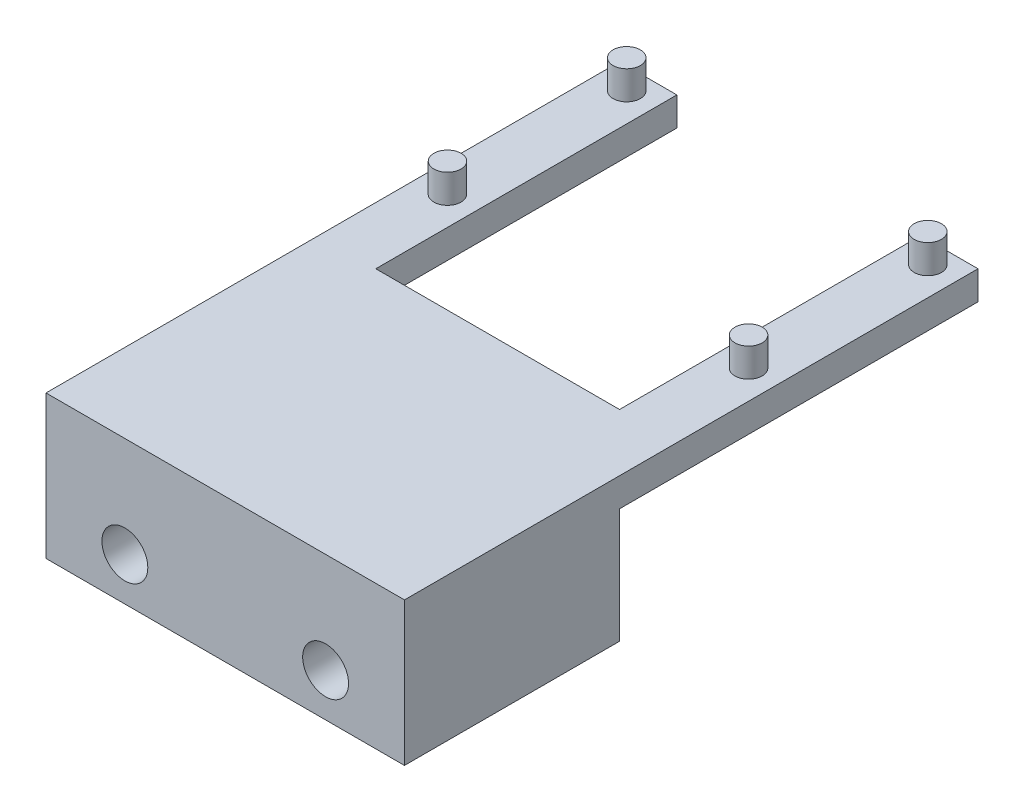
ISO-10303-21;
HEADER;
FILE_DESCRIPTION(('STEP AP214'),'2;1');
FILE_NAME('part.step','',(''),(''),'','','');
FILE_SCHEMA(('AUTOMOTIVE_DESIGN { 1 0 10303 214 1 1 1 1 }'));
ENDSEC;
DATA;
#1=APPLICATION_CONTEXT('core data for automotive mechanical design processes');
#2=APPLICATION_PROTOCOL_DEFINITION('international standard','automotive_design',2000,#1);
#3=PRODUCT_CONTEXT('',#1,'mechanical');
#4=PRODUCT('Part','Part','',(#3));
#5=PRODUCT_RELATED_PRODUCT_CATEGORY('part','',(#4));
#6=PRODUCT_DEFINITION_FORMATION('','',#4);
#7=PRODUCT_DEFINITION_CONTEXT('part definition',#1,'design');
#8=PRODUCT_DEFINITION('design','',#6,#7);
#9=PRODUCT_DEFINITION_SHAPE('','',#8);
#10=(LENGTH_UNIT() NAMED_UNIT(*) SI_UNIT(.MILLI.,.METRE.));
#11=(NAMED_UNIT(*) PLANE_ANGLE_UNIT() SI_UNIT($,.RADIAN.));
#12=(NAMED_UNIT(*) SI_UNIT($,.STERADIAN.) SOLID_ANGLE_UNIT());
#13=UNCERTAINTY_MEASURE_WITH_UNIT(LENGTH_MEASURE(1.E-05),#10,'distance_accuracy_value','');
#14=(GEOMETRIC_REPRESENTATION_CONTEXT(3) GLOBAL_UNCERTAINTY_ASSIGNED_CONTEXT((#13)) GLOBAL_UNIT_ASSIGNED_CONTEXT((#10,
#11,#12)) REPRESENTATION_CONTEXT('',''));
#15=CARTESIAN_POINT('',(0.,0.,0.));
#16=DIRECTION('',(0.,0.,1.));
#17=DIRECTION('',(1.,0.,0.));
#18=AXIS2_PLACEMENT_3D('',#15,#16,#17);
#19=CARTESIAN_POINT('',(12.5,2.,-12.5));
#20=DIRECTION('',(-1.,0.,0.));
#21=DIRECTION('',(0.,0.,1.));
#22=AXIS2_PLACEMENT_3D('',#19,#20,#21);
#23=PLANE('',#22);
#24=DIRECTION('',(0.,0.,-1.));
#25=VECTOR('',#24,1.);
#26=CARTESIAN_POINT('',(12.5,0.,-12.5));
#27=LINE('',#26,#25);
#28=CARTESIAN_POINT('',(12.5,0.,12.5));
#29=VERTEX_POINT('',#28);
#30=CARTESIAN_POINT('',(12.5,0.,-12.5));
#31=VERTEX_POINT('',#30);
#32=EDGE_CURVE('E130',#29,#31,#27,.T.);
#33=ORIENTED_EDGE('',*,*,#32,.T.);
#34=DIRECTION('',(0.,-1.,0.));
#35=VECTOR('',#34,1.);
#36=CARTESIAN_POINT('',(12.5,2.,-12.5));
#37=LINE('',#36,#35);
#38=CARTESIAN_POINT('',(12.5,2.,-12.5));
#39=VERTEX_POINT('',#38);
#40=EDGE_CURVE('E11',#39,#31,#37,.T.);
#41=ORIENTED_EDGE('',*,*,#40,.F.);
#42=DIRECTION('',(0.,0.,-1.));
#43=VECTOR('',#42,1.);
#44=CARTESIAN_POINT('',(12.5,2.,-12.5));
#45=LINE('',#44,#43);
#46=CARTESIAN_POINT('',(12.5,2.,27.5));
#47=VERTEX_POINT('',#46);
#48=EDGE_CURVE('E146',#47,#39,#45,.T.);
#49=ORIENTED_EDGE('',*,*,#48,.F.);
#50=DIRECTION('',(0.,1.,0.));
#51=VECTOR('',#50,1.);
#52=CARTESIAN_POINT('',(12.5,2.,27.5));
#53=LINE('',#52,#51);
#54=CARTESIAN_POINT('',(12.5,-8.,27.5));
#55=VERTEX_POINT('',#54);
#56=EDGE_CURVE('E175',#55,#47,#53,.T.);
#57=ORIENTED_EDGE('',*,*,#56,.F.);
#58=DIRECTION('',(0.,0.,-1.));
#59=VECTOR('',#58,1.);
#60=CARTESIAN_POINT('',(12.5,-8.,27.5));
#61=LINE('',#60,#59);
#62=CARTESIAN_POINT('',(12.5,-8.,12.5));
#63=VERTEX_POINT('',#62);
#64=EDGE_CURVE('E176',#55,#63,#61,.T.);
#65=ORIENTED_EDGE('',*,*,#64,.T.);
#66=DIRECTION('',(0.,1.,0.));
#67=VECTOR('',#66,1.);
#68=CARTESIAN_POINT('',(12.5,2.,12.5));
#69=LINE('',#68,#67);
#70=EDGE_CURVE('E191',#63,#29,#69,.T.);
#71=ORIENTED_EDGE('',*,*,#70,.T.);
#72=EDGE_LOOP('',(#33,#41,#49,#57,#65,#71));
#73=FACE_BOUND('',#72,.T.);
#74=ADVANCED_FACE('F33',(#73),#23,.F.);
#75=CARTESIAN_POINT('',(8.49999999999999,2.,-12.5));
#76=DIRECTION('',(0.,0.,1.));
#77=DIRECTION('',(1.,0.,0.));
#78=AXIS2_PLACEMENT_3D('',#75,#76,#77);
#79=PLANE('',#78);
#80=DIRECTION('',(-1.,0.,0.));
#81=VECTOR('',#80,1.);
#82=CARTESIAN_POINT('',(8.49999999999999,0.,-12.5));
#83=LINE('',#82,#81);
#84=CARTESIAN_POINT('',(8.49999999999999,0.,-12.5));
#85=VERTEX_POINT('',#84);
#86=EDGE_CURVE('E133',#31,#85,#83,.T.);
#87=ORIENTED_EDGE('',*,*,#86,.T.);
#88=DIRECTION('',(0.,-1.,0.));
#89=VECTOR('',#88,1.);
#90=CARTESIAN_POINT('',(8.49999999999999,2.,-12.5));
#91=LINE('',#90,#89);
#92=CARTESIAN_POINT('',(8.49999999999999,2.,-12.5));
#93=VERTEX_POINT('',#92);
#94=EDGE_CURVE('E41',#93,#85,#91,.T.);
#95=ORIENTED_EDGE('',*,*,#94,.F.);
#96=DIRECTION('',(-1.,0.,0.));
#97=VECTOR('',#96,1.);
#98=CARTESIAN_POINT('',(8.49999999999999,2.,-12.5));
#99=LINE('',#98,#97);
#100=EDGE_CURVE('E90',#39,#93,#99,.T.);
#101=ORIENTED_EDGE('',*,*,#100,.F.);
#102=ORIENTED_EDGE('',*,*,#40,.T.);
#103=EDGE_LOOP('',(#87,#95,#101,#102));
#104=FACE_BOUND('',#103,.T.);
#105=ADVANCED_FACE('F223',(#104),#79,.F.);
#106=CARTESIAN_POINT('',(8.49999999999999,2.,8.5));
#107=DIRECTION('',(1.,0.,0.));
#108=DIRECTION('',(0.,0.,-1.));
#109=AXIS2_PLACEMENT_3D('',#106,#107,#108);
#110=PLANE('',#109);
#111=DIRECTION('',(0.,0.,1.));
#112=VECTOR('',#111,1.);
#113=CARTESIAN_POINT('',(8.49999999999999,0.,8.5));
#114=LINE('',#113,#112);
#115=CARTESIAN_POINT('',(8.49999999999999,0.,8.5));
#116=VERTEX_POINT('',#115);
#117=EDGE_CURVE('E136',#85,#116,#114,.T.);
#118=ORIENTED_EDGE('',*,*,#117,.T.);
#119=DIRECTION('',(0.,-1.,0.));
#120=VECTOR('',#119,1.);
#121=CARTESIAN_POINT('',(8.49999999999999,2.,8.5));
#122=LINE('',#121,#120);
#123=CARTESIAN_POINT('',(8.49999999999999,2.,8.5));
#124=VERTEX_POINT('',#123);
#125=EDGE_CURVE('E119',#124,#116,#122,.T.);
#126=ORIENTED_EDGE('',*,*,#125,.F.);
#127=DIRECTION('',(0.,0.,1.));
#128=VECTOR('',#127,1.);
#129=CARTESIAN_POINT('',(8.49999999999999,2.,8.5));
#130=LINE('',#129,#128);
#131=EDGE_CURVE('E107',#93,#124,#130,.T.);
#132=ORIENTED_EDGE('',*,*,#131,.F.);
#133=ORIENTED_EDGE('',*,*,#94,.T.);
#134=EDGE_LOOP('',(#118,#126,#132,#133));
#135=FACE_BOUND('',#134,.T.);
#136=ADVANCED_FACE('F152',(#135),#110,.F.);
#137=CARTESIAN_POINT('',(-8.50000000000001,2.,8.5));
#138=DIRECTION('',(0.,0.,1.));
#139=DIRECTION('',(1.,0.,0.));
#140=AXIS2_PLACEMENT_3D('',#137,#138,#139);
#141=PLANE('',#140);
#142=DIRECTION('',(-1.,0.,0.));
#143=VECTOR('',#142,1.);
#144=CARTESIAN_POINT('',(-8.50000000000001,0.,8.5));
#145=LINE('',#144,#143);
#146=CARTESIAN_POINT('',(-8.50000000000001,0.,8.5));
#147=VERTEX_POINT('',#146);
#148=EDGE_CURVE('E116',#116,#147,#145,.T.);
#149=ORIENTED_EDGE('',*,*,#148,.T.);
#150=DIRECTION('',(0.,-1.,0.));
#151=VECTOR('',#150,1.);
#152=CARTESIAN_POINT('',(-8.50000000000001,2.,8.5));
#153=LINE('',#152,#151);
#154=CARTESIAN_POINT('',(-8.50000000000001,2.,8.5));
#155=VERTEX_POINT('',#154);
#156=EDGE_CURVE('E113',#155,#147,#153,.T.);
#157=ORIENTED_EDGE('',*,*,#156,.F.);
#158=DIRECTION('',(-1.,0.,0.));
#159=VECTOR('',#158,1.);
#160=CARTESIAN_POINT('',(-8.50000000000001,2.,8.5));
#161=LINE('',#160,#159);
#162=EDGE_CURVE('E100',#124,#155,#161,.T.);
#163=ORIENTED_EDGE('',*,*,#162,.F.);
#164=ORIENTED_EDGE('',*,*,#125,.T.);
#165=EDGE_LOOP('',(#149,#157,#163,#164));
#166=FACE_BOUND('',#165,.T.);
#167=ADVANCED_FACE('F114',(#166),#141,.F.);
#168=CARTESIAN_POINT('',(-8.50000000000001,2.,-12.5));
#169=DIRECTION('',(-1.,0.,0.));
#170=DIRECTION('',(0.,0.,1.));
#171=AXIS2_PLACEMENT_3D('',#168,#169,#170);
#172=PLANE('',#171);
#173=DIRECTION('',(0.,0.,-1.));
#174=VECTOR('',#173,1.);
#175=CARTESIAN_POINT('',(-8.50000000000001,0.,-12.5));
#176=LINE('',#175,#174);
#177=CARTESIAN_POINT('',(-8.50000000000001,0.,-12.5));
#178=VERTEX_POINT('',#177);
#179=EDGE_CURVE('E139',#147,#178,#176,.T.);
#180=ORIENTED_EDGE('',*,*,#179,.T.);
#181=DIRECTION('',(0.,-1.,0.));
#182=VECTOR('',#181,1.);
#183=CARTESIAN_POINT('',(-8.50000000000001,2.,-12.5));
#184=LINE('',#183,#182);
#185=CARTESIAN_POINT('',(-8.50000000000001,2.,-12.5));
#186=VERTEX_POINT('',#185);
#187=EDGE_CURVE('E120',#186,#178,#184,.T.);
#188=ORIENTED_EDGE('',*,*,#187,.F.);
#189=DIRECTION('',(0.,0.,-1.));
#190=VECTOR('',#189,1.);
#191=CARTESIAN_POINT('',(-8.50000000000001,2.,-12.5));
#192=LINE('',#191,#190);
#193=EDGE_CURVE('E104',#155,#186,#192,.T.);
#194=ORIENTED_EDGE('',*,*,#193,.F.);
#195=ORIENTED_EDGE('',*,*,#156,.T.);
#196=EDGE_LOOP('',(#180,#188,#194,#195));
#197=FACE_BOUND('',#196,.T.);
#198=ADVANCED_FACE('F122',(#197),#172,.F.);
#199=CARTESIAN_POINT('',(-12.5,2.,-12.5));
#200=DIRECTION('',(0.,0.,1.));
#201=DIRECTION('',(1.,0.,0.));
#202=AXIS2_PLACEMENT_3D('',#199,#200,#201);
#203=PLANE('',#202);
#204=DIRECTION('',(-1.,0.,0.));
#205=VECTOR('',#204,1.);
#206=CARTESIAN_POINT('',(-12.5,0.,-12.5));
#207=LINE('',#206,#205);
#208=CARTESIAN_POINT('',(-12.5,0.,-12.5));
#209=VERTEX_POINT('',#208);
#210=EDGE_CURVE('E75',#178,#209,#207,.T.);
#211=ORIENTED_EDGE('',*,*,#210,.T.);
#212=DIRECTION('',(0.,-1.,0.));
#213=VECTOR('',#212,1.);
#214=CARTESIAN_POINT('',(-12.5,2.,-12.5));
#215=LINE('',#214,#213);
#216=CARTESIAN_POINT('',(-12.5,2.,-12.5));
#217=VERTEX_POINT('',#216);
#218=EDGE_CURVE('E129',#217,#209,#215,.T.);
#219=ORIENTED_EDGE('',*,*,#218,.F.);
#220=DIRECTION('',(-1.,0.,0.));
#221=VECTOR('',#220,1.);
#222=CARTESIAN_POINT('',(-12.5,2.,-12.5));
#223=LINE('',#222,#221);
#224=EDGE_CURVE('E49',#186,#217,#223,.T.);
#225=ORIENTED_EDGE('',*,*,#224,.F.);
#226=ORIENTED_EDGE('',*,*,#187,.T.);
#227=EDGE_LOOP('',(#211,#219,#225,#226));
#228=FACE_BOUND('',#227,.T.);
#229=ADVANCED_FACE('F156',(#228),#203,.F.);
#230=CARTESIAN_POINT('',(-12.5,2.,-12.5));
#231=DIRECTION('',(1.,0.,0.));
#232=DIRECTION('',(0.,0.,-1.));
#233=AXIS2_PLACEMENT_3D('',#230,#231,#232);
#234=PLANE('',#233);
#235=DIRECTION('',(0.,0.,1.));
#236=VECTOR('',#235,1.);
#237=CARTESIAN_POINT('',(-12.5,0.,-12.5));
#238=LINE('',#237,#236);
#239=CARTESIAN_POINT('',(-12.5,0.,12.5));
#240=VERTEX_POINT('',#239);
#241=EDGE_CURVE('E82',#209,#240,#238,.T.);
#242=ORIENTED_EDGE('',*,*,#241,.T.);
#243=DIRECTION('',(0.,-1.,0.));
#244=VECTOR('',#243,1.);
#245=CARTESIAN_POINT('',(-12.5,2.,12.5));
#246=LINE('',#245,#244);
#247=CARTESIAN_POINT('',(-12.5,-8.,12.5));
#248=VERTEX_POINT('',#247);
#249=EDGE_CURVE('E185',#240,#248,#246,.T.);
#250=ORIENTED_EDGE('',*,*,#249,.T.);
#251=DIRECTION('',(0.,0.,-1.));
#252=VECTOR('',#251,1.);
#253=CARTESIAN_POINT('',(-12.5,-8.,27.5));
#254=LINE('',#253,#252);
#255=CARTESIAN_POINT('',(-12.5,-8.,27.5));
#256=VERTEX_POINT('',#255);
#257=EDGE_CURVE('E179',#256,#248,#254,.T.);
#258=ORIENTED_EDGE('',*,*,#257,.F.);
#259=DIRECTION('',(0.,-1.,0.));
#260=VECTOR('',#259,1.);
#261=CARTESIAN_POINT('',(-12.5,2.,27.5));
#262=LINE('',#261,#260);
#263=CARTESIAN_POINT('',(-12.5,2.,27.5));
#264=VERTEX_POINT('',#263);
#265=EDGE_CURVE('E163',#264,#256,#262,.T.);
#266=ORIENTED_EDGE('',*,*,#265,.F.);
#267=DIRECTION('',(0.,0.,1.));
#268=VECTOR('',#267,1.);
#269=CARTESIAN_POINT('',(-12.5,2.,-12.5));
#270=LINE('',#269,#268);
#271=EDGE_CURVE('E124',#217,#264,#270,.T.);
#272=ORIENTED_EDGE('',*,*,#271,.F.);
#273=ORIENTED_EDGE('',*,*,#218,.T.);
#274=EDGE_LOOP('',(#242,#250,#258,#266,#272,#273));
#275=FACE_BOUND('',#274,.T.);
#276=ADVANCED_FACE('F159',(#275),#234,.F.);
#277=CARTESIAN_POINT('',(0.,2.,0.));
#278=DIRECTION('',(0.,1.,0.));
#279=DIRECTION('',(0.,0.,1.));
#280=AXIS2_PLACEMENT_3D('',#277,#278,#279);
#281=PLANE('',#280);
#282=CARTESIAN_POINT('',(10.5,2.,1.5));
#283=DIRECTION('',(0.,1.,0.));
#284=DIRECTION('',(0.,0.,1.));
#285=AXIS2_PLACEMENT_3D('',#282,#283,#284);
#286=CIRCLE('',#285,0.949999999999999);
#287=CARTESIAN_POINT('',(10.5,2.,2.45));
#288=VERTEX_POINT('',#287);
#289=EDGE_CURVE('E196',#288,#288,#286,.T.);
#290=ORIENTED_EDGE('',*,*,#289,.F.);
#291=EDGE_LOOP('',(#290));
#292=FACE_BOUND('',#291,.T.);
#293=CARTESIAN_POINT('',(10.5,2.,-11.));
#294=DIRECTION('',(0.,1.,0.));
#295=DIRECTION('',(0.,0.,1.));
#296=AXIS2_PLACEMENT_3D('',#293,#294,#295);
#297=CIRCLE('',#296,0.949999999999999);
#298=CARTESIAN_POINT('',(10.5,2.,-10.05));
#299=VERTEX_POINT('',#298);
#300=EDGE_CURVE('E200',#299,#299,#297,.T.);
#301=ORIENTED_EDGE('',*,*,#300,.F.);
#302=EDGE_LOOP('',(#301));
#303=FACE_BOUND('',#302,.T.);
#304=CARTESIAN_POINT('',(-10.5,2.,1.5));
#305=DIRECTION('',(0.,1.,0.));
#306=DIRECTION('',(0.,0.,1.));
#307=AXIS2_PLACEMENT_3D('',#304,#305,#306);
#308=CIRCLE('',#307,0.949999999999999);
#309=CARTESIAN_POINT('',(-10.5,2.,2.45));
#310=VERTEX_POINT('',#309);
#311=EDGE_CURVE('E206',#310,#310,#308,.T.);
#312=ORIENTED_EDGE('',*,*,#311,.F.);
#313=EDGE_LOOP('',(#312));
#314=FACE_BOUND('',#313,.T.);
#315=CARTESIAN_POINT('',(-10.5,2.,-11.));
#316=DIRECTION('',(0.,1.,0.));
#317=DIRECTION('',(0.,0.,1.));
#318=AXIS2_PLACEMENT_3D('',#315,#316,#317);
#319=CIRCLE('',#318,0.949999999999999);
#320=CARTESIAN_POINT('',(-10.5,2.,-10.05));
#321=VERTEX_POINT('',#320);
#322=EDGE_CURVE('E212',#321,#321,#319,.T.);
#323=ORIENTED_EDGE('',*,*,#322,.F.);
#324=EDGE_LOOP('',(#323));
#325=FACE_BOUND('',#324,.T.);
#326=ORIENTED_EDGE('',*,*,#48,.T.);
#327=ORIENTED_EDGE('',*,*,#100,.T.);
#328=ORIENTED_EDGE('',*,*,#131,.T.);
#329=ORIENTED_EDGE('',*,*,#162,.T.);
#330=ORIENTED_EDGE('',*,*,#193,.T.);
#331=ORIENTED_EDGE('',*,*,#224,.T.);
#332=ORIENTED_EDGE('',*,*,#271,.T.);
#333=DIRECTION('',(-1.,0.,0.));
#334=VECTOR('',#333,1.);
#335=CARTESIAN_POINT('',(-12.5,2.,27.5));
#336=LINE('',#335,#334);
#337=EDGE_CURVE('E167',#47,#264,#336,.T.);
#338=ORIENTED_EDGE('',*,*,#337,.F.);
#339=EDGE_LOOP('',(#326,#327,#328,#329,#330,#331,#332,#338));
#340=FACE_BOUND('',#339,.T.);
#341=ADVANCED_FACE('F102',(#292,#303,#314,#325,#340),#281,.T.);
#342=CARTESIAN_POINT('',(0.,0.,0.));
#343=DIRECTION('',(0.,1.,0.));
#344=DIRECTION('',(0.,0.,1.));
#345=AXIS2_PLACEMENT_3D('',#342,#343,#344);
#346=PLANE('',#345);
#347=ORIENTED_EDGE('',*,*,#32,.F.);
#348=DIRECTION('',(1.,0.,0.));
#349=VECTOR('',#348,1.);
#350=CARTESIAN_POINT('',(-12.5,0.,12.5));
#351=LINE('',#350,#349);
#352=EDGE_CURVE('E143',#240,#29,#351,.T.);
#353=ORIENTED_EDGE('',*,*,#352,.F.);
#354=ORIENTED_EDGE('',*,*,#241,.F.);
#355=ORIENTED_EDGE('',*,*,#210,.F.);
#356=ORIENTED_EDGE('',*,*,#179,.F.);
#357=ORIENTED_EDGE('',*,*,#148,.F.);
#358=ORIENTED_EDGE('',*,*,#117,.F.);
#359=ORIENTED_EDGE('',*,*,#86,.F.);
#360=EDGE_LOOP('',(#347,#353,#354,#355,#356,#357,#358,#359));
#361=FACE_BOUND('',#360,.T.);
#362=ADVANCED_FACE('F155',(#361),#346,.F.);
#363=CARTESIAN_POINT('',(-10.5,4.,-11.));
#364=DIRECTION('',(0.,-1.,0.));
#365=DIRECTION('',(0.,0.,-1.));
#366=AXIS2_PLACEMENT_3D('',#363,#364,#365);
#367=CYLINDRICAL_SURFACE('',#366,0.949999999999999);
#368=CARTESIAN_POINT('',(-10.5,4.,-11.));
#369=DIRECTION('',(0.,1.,0.));
#370=DIRECTION('',(0.,0.,1.));
#371=AXIS2_PLACEMENT_3D('',#368,#369,#370);
#372=CIRCLE('',#371,0.949999999999999);
#373=CARTESIAN_POINT('',(-10.5,4.,-10.05));
#374=VERTEX_POINT('',#373);
#375=EDGE_CURVE('E134',#374,#374,#372,.T.);
#376=ORIENTED_EDGE('',*,*,#375,.F.);
#377=EDGE_LOOP('',(#376));
#378=FACE_BOUND('',#377,.T.);
#379=ORIENTED_EDGE('',*,*,#322,.T.);
#380=EDGE_LOOP('',(#379));
#381=FACE_BOUND('',#380,.T.);
#382=ADVANCED_FACE('F241',(#378,#381),#367,.T.);
#383=CARTESIAN_POINT('',(-10.5,4.,-11.));
#384=DIRECTION('',(0.,1.,0.));
#385=DIRECTION('',(0.,0.,1.));
#386=AXIS2_PLACEMENT_3D('',#383,#384,#385);
#387=PLANE('',#386);
#388=ORIENTED_EDGE('',*,*,#375,.T.);
#389=EDGE_LOOP('',(#388));
#390=FACE_BOUND('',#389,.T.);
#391=ADVANCED_FACE('F247',(#390),#387,.T.);
#392=CARTESIAN_POINT('',(-10.5,4.,1.5));
#393=DIRECTION('',(0.,-1.,0.));
#394=DIRECTION('',(0.,0.,-1.));
#395=AXIS2_PLACEMENT_3D('',#392,#393,#394);
#396=CYLINDRICAL_SURFACE('',#395,0.949999999999999);
#397=CARTESIAN_POINT('',(-10.5,4.,1.5));
#398=DIRECTION('',(0.,1.,0.));
#399=DIRECTION('',(0.,0.,1.));
#400=AXIS2_PLACEMENT_3D('',#397,#398,#399);
#401=CIRCLE('',#400,0.949999999999999);
#402=CARTESIAN_POINT('',(-10.5,4.,2.45));
#403=VERTEX_POINT('',#402);
#404=EDGE_CURVE('E209',#403,#403,#401,.T.);
#405=ORIENTED_EDGE('',*,*,#404,.F.);
#406=EDGE_LOOP('',(#405));
#407=FACE_BOUND('',#406,.T.);
#408=ORIENTED_EDGE('',*,*,#311,.T.);
#409=EDGE_LOOP('',(#408));
#410=FACE_BOUND('',#409,.T.);
#411=ADVANCED_FACE('F251',(#407,#410),#396,.T.);
#412=CARTESIAN_POINT('',(-10.5,4.,1.5));
#413=DIRECTION('',(0.,1.,0.));
#414=DIRECTION('',(0.,0.,1.));
#415=AXIS2_PLACEMENT_3D('',#412,#413,#414);
#416=PLANE('',#415);
#417=ORIENTED_EDGE('',*,*,#404,.T.);
#418=EDGE_LOOP('',(#417));
#419=FACE_BOUND('',#418,.T.);
#420=ADVANCED_FACE('F255',(#419),#416,.T.);
#421=CARTESIAN_POINT('',(10.5,4.,-11.));
#422=DIRECTION('',(0.,-1.,0.));
#423=DIRECTION('',(0.,0.,-1.));
#424=AXIS2_PLACEMENT_3D('',#421,#422,#423);
#425=CYLINDRICAL_SURFACE('',#424,0.949999999999999);
#426=CARTESIAN_POINT('',(10.5,4.,-11.));
#427=DIRECTION('',(0.,1.,0.));
#428=DIRECTION('',(0.,0.,1.));
#429=AXIS2_PLACEMENT_3D('',#426,#427,#428);
#430=CIRCLE('',#429,0.949999999999999);
#431=CARTESIAN_POINT('',(10.5,4.,-10.05));
#432=VERTEX_POINT('',#431);
#433=EDGE_CURVE('E203',#432,#432,#430,.T.);
#434=ORIENTED_EDGE('',*,*,#433,.F.);
#435=EDGE_LOOP('',(#434));
#436=FACE_BOUND('',#435,.T.);
#437=ORIENTED_EDGE('',*,*,#300,.T.);
#438=EDGE_LOOP('',(#437));
#439=FACE_BOUND('',#438,.T.);
#440=ADVANCED_FACE('F259',(#436,#439),#425,.T.);
#441=CARTESIAN_POINT('',(10.5,4.,-11.));
#442=DIRECTION('',(0.,1.,0.));
#443=DIRECTION('',(0.,0.,1.));
#444=AXIS2_PLACEMENT_3D('',#441,#442,#443);
#445=PLANE('',#444);
#446=ORIENTED_EDGE('',*,*,#433,.T.);
#447=EDGE_LOOP('',(#446));
#448=FACE_BOUND('',#447,.T.);
#449=ADVANCED_FACE('F263',(#448),#445,.T.);
#450=CARTESIAN_POINT('',(10.5,4.,1.5));
#451=DIRECTION('',(0.,-1.,0.));
#452=DIRECTION('',(0.,0.,-1.));
#453=AXIS2_PLACEMENT_3D('',#450,#451,#452);
#454=CYLINDRICAL_SURFACE('',#453,0.949999999999999);
#455=CARTESIAN_POINT('',(10.5,4.,1.5));
#456=DIRECTION('',(0.,1.,0.));
#457=DIRECTION('',(0.,0.,1.));
#458=AXIS2_PLACEMENT_3D('',#455,#456,#457);
#459=CIRCLE('',#458,0.949999999999999);
#460=CARTESIAN_POINT('',(10.5,4.,2.45));
#461=VERTEX_POINT('',#460);
#462=EDGE_CURVE('E197',#461,#461,#459,.T.);
#463=ORIENTED_EDGE('',*,*,#462,.F.);
#464=EDGE_LOOP('',(#463));
#465=FACE_BOUND('',#464,.T.);
#466=ORIENTED_EDGE('',*,*,#289,.T.);
#467=EDGE_LOOP('',(#466));
#468=FACE_BOUND('',#467,.T.);
#469=ADVANCED_FACE('F267',(#465,#468),#454,.T.);
#470=CARTESIAN_POINT('',(10.5,4.,1.5));
#471=DIRECTION('',(0.,1.,0.));
#472=DIRECTION('',(0.,0.,1.));
#473=AXIS2_PLACEMENT_3D('',#470,#471,#472);
#474=PLANE('',#473);
#475=ORIENTED_EDGE('',*,*,#462,.T.);
#476=EDGE_LOOP('',(#475));
#477=FACE_BOUND('',#476,.T.);
#478=ADVANCED_FACE('F271',(#477),#474,.T.);
#479=CARTESIAN_POINT('',(0.,0.,12.5));
#480=DIRECTION('',(0.,0.,1.));
#481=DIRECTION('',(1.,0.,0.));
#482=AXIS2_PLACEMENT_3D('',#479,#480,#481);
#483=PLANE('',#482);
#484=CARTESIAN_POINT('',(-7.,-5.,12.5));
#485=DIRECTION('',(0.,0.,1.));
#486=DIRECTION('',(1.,0.,0.));
#487=AXIS2_PLACEMENT_3D('',#484,#485,#486);
#488=CIRCLE('',#487,1.6);
#489=CARTESIAN_POINT('',(-5.4,-5.,12.5));
#490=VERTEX_POINT('',#489);
#491=EDGE_CURVE('E188',#490,#490,#488,.T.);
#492=ORIENTED_EDGE('',*,*,#491,.T.);
#493=EDGE_LOOP('',(#492));
#494=FACE_BOUND('',#493,.T.);
#495=CARTESIAN_POINT('',(7.,-5.,12.5));
#496=DIRECTION('',(0.,0.,1.));
#497=DIRECTION('',(1.,0.,0.));
#498=AXIS2_PLACEMENT_3D('',#495,#496,#497);
#499=CIRCLE('',#498,1.6);
#500=CARTESIAN_POINT('',(8.6,-5.,12.5));
#501=VERTEX_POINT('',#500);
#502=EDGE_CURVE('E302',#501,#501,#499,.T.);
#503=ORIENTED_EDGE('',*,*,#502,.T.);
#504=EDGE_LOOP('',(#503));
#505=FACE_BOUND('',#504,.T.);
#506=ORIENTED_EDGE('',*,*,#249,.F.);
#507=ORIENTED_EDGE('',*,*,#352,.T.);
#508=ORIENTED_EDGE('',*,*,#70,.F.);
#509=DIRECTION('',(1.,0.,0.));
#510=VECTOR('',#509,1.);
#511=CARTESIAN_POINT('',(-12.5,-8.,12.5));
#512=LINE('',#511,#510);
#513=EDGE_CURVE('E187',#248,#63,#512,.T.);
#514=ORIENTED_EDGE('',*,*,#513,.F.);
#515=EDGE_LOOP('',(#506,#507,#508,#514));
#516=FACE_BOUND('',#515,.T.);
#517=ADVANCED_FACE('F275',(#494,#505,#516),#483,.F.);
#518=CARTESIAN_POINT('',(-12.5,-8.,27.5));
#519=DIRECTION('',(0.,1.,0.));
#520=DIRECTION('',(0.,0.,1.));
#521=AXIS2_PLACEMENT_3D('',#518,#519,#520);
#522=PLANE('',#521);
#523=ORIENTED_EDGE('',*,*,#513,.T.);
#524=ORIENTED_EDGE('',*,*,#64,.F.);
#525=DIRECTION('',(1.,0.,0.));
#526=VECTOR('',#525,1.);
#527=CARTESIAN_POINT('',(-12.5,-8.,27.5));
#528=LINE('',#527,#526);
#529=EDGE_CURVE('E181',#256,#55,#528,.T.);
#530=ORIENTED_EDGE('',*,*,#529,.F.);
#531=ORIENTED_EDGE('',*,*,#257,.T.);
#532=EDGE_LOOP('',(#523,#524,#530,#531));
#533=FACE_BOUND('',#532,.T.);
#534=ADVANCED_FACE('F277',(#533),#522,.F.);
#535=CARTESIAN_POINT('',(0.,0.,27.5));
#536=DIRECTION('',(0.,0.,1.));
#537=DIRECTION('',(1.,0.,0.));
#538=AXIS2_PLACEMENT_3D('',#535,#536,#537);
#539=PLANE('',#538);
#540=CARTESIAN_POINT('',(-7.,-5.,27.5));
#541=DIRECTION('',(0.,0.,1.));
#542=DIRECTION('',(1.,0.,0.));
#543=AXIS2_PLACEMENT_3D('',#540,#541,#542);
#544=CIRCLE('',#543,1.6);
#545=CARTESIAN_POINT('',(-5.4,-5.,27.5));
#546=VERTEX_POINT('',#545);
#547=EDGE_CURVE('E299',#546,#546,#544,.T.);
#548=ORIENTED_EDGE('',*,*,#547,.F.);
#549=EDGE_LOOP('',(#548));
#550=FACE_BOUND('',#549,.T.);
#551=CARTESIAN_POINT('',(7.,-5.,27.5));
#552=DIRECTION('',(0.,0.,1.));
#553=DIRECTION('',(1.,0.,0.));
#554=AXIS2_PLACEMENT_3D('',#551,#552,#553);
#555=CIRCLE('',#554,1.6);
#556=CARTESIAN_POINT('',(8.6,-5.,27.5));
#557=VERTEX_POINT('',#556);
#558=EDGE_CURVE('E321',#557,#557,#555,.T.);
#559=ORIENTED_EDGE('',*,*,#558,.F.);
#560=EDGE_LOOP('',(#559));
#561=FACE_BOUND('',#560,.T.);
#562=ORIENTED_EDGE('',*,*,#265,.T.);
#563=ORIENTED_EDGE('',*,*,#529,.T.);
#564=ORIENTED_EDGE('',*,*,#56,.T.);
#565=ORIENTED_EDGE('',*,*,#337,.T.);
#566=EDGE_LOOP('',(#562,#563,#564,#565));
#567=FACE_BOUND('',#566,.T.);
#568=ADVANCED_FACE('F171',(#550,#561,#567),#539,.T.);
#569=CARTESIAN_POINT('',(7.,-5.,7.5));
#570=DIRECTION('',(0.,0.,1.));
#571=DIRECTION('',(1.,0.,0.));
#572=AXIS2_PLACEMENT_3D('',#569,#570,#571);
#573=CYLINDRICAL_SURFACE('',#572,1.6);
#574=ORIENTED_EDGE('',*,*,#558,.T.);
#575=EDGE_LOOP('',(#574));
#576=FACE_BOUND('',#575,.T.);
#577=ORIENTED_EDGE('',*,*,#502,.F.);
#578=EDGE_LOOP('',(#577));
#579=FACE_BOUND('',#578,.T.);
#580=ADVANCED_FACE('F286',(#576,#579),#573,.F.);
#581=CARTESIAN_POINT('',(-7.,-5.,7.5));
#582=DIRECTION('',(0.,0.,1.));
#583=DIRECTION('',(1.,0.,0.));
#584=AXIS2_PLACEMENT_3D('',#581,#582,#583);
#585=CYLINDRICAL_SURFACE('',#584,1.6);
#586=ORIENTED_EDGE('',*,*,#547,.T.);
#587=EDGE_LOOP('',(#586));
#588=FACE_BOUND('',#587,.T.);
#589=ORIENTED_EDGE('',*,*,#491,.F.);
#590=EDGE_LOOP('',(#589));
#591=FACE_BOUND('',#590,.T.);
#592=ADVANCED_FACE('F290',(#588,#591),#585,.F.);
#593=CLOSED_SHELL('',(#74,#105,#136,#167,#198,#229,#276,#341,#362,#382,#391,#411,#420,#440,#449,
#469,#478,#517,#534,#568,#580,#592));
#594=MANIFOLD_SOLID_BREP('B2',#593);
#595=ADVANCED_BREP_SHAPE_REPRESENTATION('',(#18,#594),#14);
#596=SHAPE_DEFINITION_REPRESENTATION(#9,#595);
ENDSEC;
END-ISO-10303-21;
